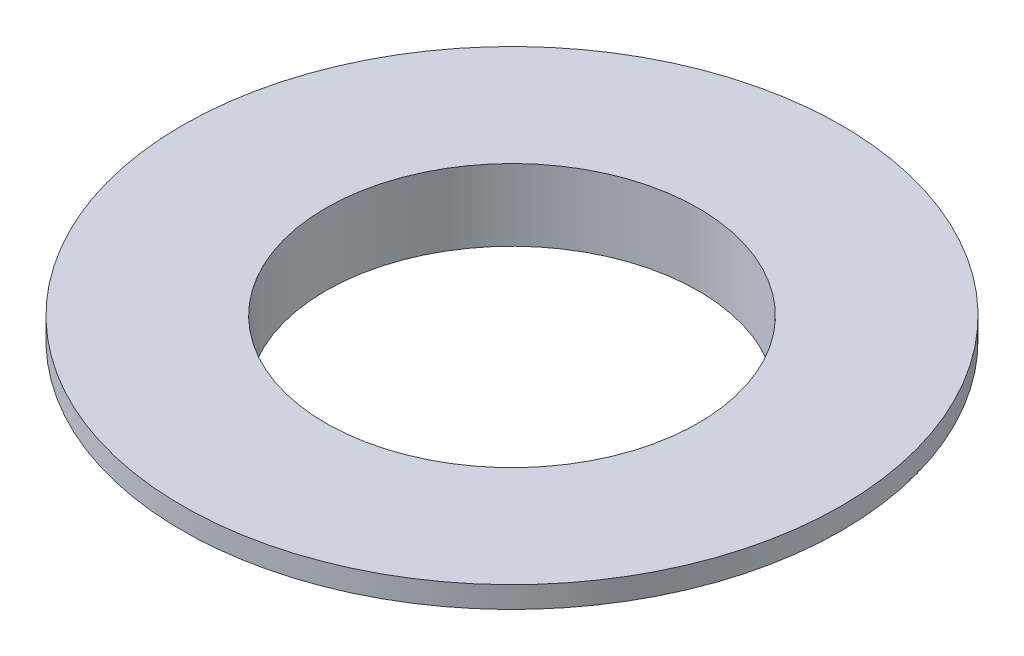
ISO-10303-21;
HEADER;
FILE_DESCRIPTION(('STEP AP214'),'2;1');
FILE_NAME('part.step','',(''),(''),'','','');
FILE_SCHEMA(('AUTOMOTIVE_DESIGN { 1 0 10303 214 1 1 1 1 }'));
ENDSEC;
DATA;
#1=APPLICATION_CONTEXT('core data for automotive mechanical design processes');
#2=APPLICATION_PROTOCOL_DEFINITION('international standard','automotive_design',2000,#1);
#3=PRODUCT_CONTEXT('',#1,'mechanical');
#4=PRODUCT('Part','Part','',(#3));
#5=PRODUCT_RELATED_PRODUCT_CATEGORY('part','',(#4));
#6=PRODUCT_DEFINITION_FORMATION('','',#4);
#7=PRODUCT_DEFINITION_CONTEXT('part definition',#1,'design');
#8=PRODUCT_DEFINITION('design','',#6,#7);
#9=PRODUCT_DEFINITION_SHAPE('','',#8);
#10=(LENGTH_UNIT() NAMED_UNIT(*) SI_UNIT(.MILLI.,.METRE.));
#11=(NAMED_UNIT(*) PLANE_ANGLE_UNIT() SI_UNIT($,.RADIAN.));
#12=(NAMED_UNIT(*) SI_UNIT($,.STERADIAN.) SOLID_ANGLE_UNIT());
#13=UNCERTAINTY_MEASURE_WITH_UNIT(LENGTH_MEASURE(1.E-05),#10,'distance_accuracy_value','');
#14=(GEOMETRIC_REPRESENTATION_CONTEXT(3) GLOBAL_UNCERTAINTY_ASSIGNED_CONTEXT((#13)) GLOBAL_UNIT_ASSIGNED_CONTEXT((#10,
#11,#12)) REPRESENTATION_CONTEXT('',''));
#15=CARTESIAN_POINT('',(0.,0.,0.));
#16=DIRECTION('',(0.,0.,1.));
#17=DIRECTION('',(1.,0.,0.));
#18=AXIS2_PLACEMENT_3D('',#15,#16,#17);
#19=CARTESIAN_POINT('',(4.,0.,0.));
#20=DIRECTION('',(0.,1.,0.));
#21=DIRECTION('',(-1.,0.,0.));
#22=AXIS2_PLACEMENT_3D('',#19,#20,#21);
#23=PLANE('',#22);
#24=CARTESIAN_POINT('',(-26.,0.,0.));
#25=DIRECTION('',(0.,1.,0.));
#26=DIRECTION('',(-1.,0.,0.));
#27=AXIS2_PLACEMENT_3D('',#24,#25,#26);
#28=CIRCLE('',#27,30.);
#29=CARTESIAN_POINT('',(-56.,0.,0.));
#30=VERTEX_POINT('',#29);
#31=EDGE_CURVE('E56',#30,#30,#28,.T.);
#32=ORIENTED_EDGE('',*,*,#31,.F.);
#33=EDGE_LOOP('',(#32));
#34=FACE_BOUND('',#33,.T.);
#35=CARTESIAN_POINT('',(-26.,0.,0.));
#36=DIRECTION('',(0.,1.,0.));
#37=DIRECTION('',(-1.,0.,0.));
#38=AXIS2_PLACEMENT_3D('',#35,#36,#37);
#39=CIRCLE('',#38,26.);
#40=CARTESIAN_POINT('',(-52.,0.,0.));
#41=VERTEX_POINT('',#40);
#42=EDGE_CURVE('E10',#41,#41,#39,.T.);
#43=ORIENTED_EDGE('',*,*,#42,.T.);
#44=EDGE_LOOP('',(#43));
#45=FACE_BOUND('',#44,.T.);
#46=ADVANCED_FACE('F34',(#34,#45),#23,.F.);
#47=CARTESIAN_POINT('',(-26.,37.8689790579778,0.));
#48=DIRECTION('',(0.,1.,0.));
#49=DIRECTION('',(-1.,0.,0.));
#50=AXIS2_PLACEMENT_3D('',#47,#48,#49);
#51=CYLINDRICAL_SURFACE('',#50,26.);
#52=ORIENTED_EDGE('',*,*,#42,.F.);
#53=EDGE_LOOP('',(#52));
#54=FACE_BOUND('',#53,.T.);
#55=CARTESIAN_POINT('',(-26.,10.,0.));
#56=DIRECTION('',(0.,1.,0.));
#57=DIRECTION('',(-1.,0.,0.));
#58=AXIS2_PLACEMENT_3D('',#55,#56,#57);
#59=CIRCLE('',#58,26.);
#60=CARTESIAN_POINT('',(-52.,9.99999999999999,0.));
#61=VERTEX_POINT('',#60);
#62=EDGE_CURVE('E40',#61,#61,#59,.T.);
#63=ORIENTED_EDGE('',*,*,#62,.T.);
#64=EDGE_LOOP('',(#63));
#65=FACE_BOUND('',#64,.T.);
#66=ADVANCED_FACE('F63',(#54,#65),#51,.F.);
#67=CARTESIAN_POINT('',(0.,10.,0.));
#68=DIRECTION('',(0.,-1.,0.));
#69=DIRECTION('',(1.,0.,0.));
#70=AXIS2_PLACEMENT_3D('',#67,#68,#69);
#71=PLANE('',#70);
#72=ORIENTED_EDGE('',*,*,#62,.F.);
#73=EDGE_LOOP('',(#72));
#74=FACE_BOUND('',#73,.T.);
#75=CARTESIAN_POINT('',(-26.,9.99999999999999,0.));
#76=DIRECTION('',(0.,1.,0.));
#77=DIRECTION('',(-1.,0.,0.));
#78=AXIS2_PLACEMENT_3D('',#75,#76,#77);
#79=CIRCLE('',#78,46.);
#80=CARTESIAN_POINT('',(-72.,9.99999999999999,0.));
#81=VERTEX_POINT('',#80);
#82=EDGE_CURVE('E44',#81,#81,#79,.T.);
#83=ORIENTED_EDGE('',*,*,#82,.T.);
#84=EDGE_LOOP('',(#83));
#85=FACE_BOUND('',#84,.T.);
#86=ADVANCED_FACE('F67',(#74,#85),#71,.F.);
#87=CARTESIAN_POINT('',(-26.,37.8689790579778,0.));
#88=DIRECTION('',(0.,1.,0.));
#89=DIRECTION('',(-1.,0.,0.));
#90=AXIS2_PLACEMENT_3D('',#87,#88,#89);
#91=CYLINDRICAL_SURFACE('',#90,46.);
#92=ORIENTED_EDGE('',*,*,#82,.F.);
#93=EDGE_LOOP('',(#92));
#94=FACE_BOUND('',#93,.T.);
#95=CARTESIAN_POINT('',(-26.,7.,0.));
#96=DIRECTION('',(0.,1.,0.));
#97=DIRECTION('',(-1.,0.,0.));
#98=AXIS2_PLACEMENT_3D('',#95,#96,#97);
#99=CIRCLE('',#98,46.);
#100=CARTESIAN_POINT('',(-72.,6.99999999999999,0.));
#101=VERTEX_POINT('',#100);
#102=EDGE_CURVE('E48',#101,#101,#99,.T.);
#103=ORIENTED_EDGE('',*,*,#102,.T.);
#104=EDGE_LOOP('',(#103));
#105=FACE_BOUND('',#104,.T.);
#106=ADVANCED_FACE('F72',(#94,#105),#91,.T.);
#107=CARTESIAN_POINT('',(20.,7.,0.));
#108=DIRECTION('',(0.,1.,0.));
#109=DIRECTION('',(-1.,0.,0.));
#110=AXIS2_PLACEMENT_3D('',#107,#108,#109);
#111=PLANE('',#110);
#112=ORIENTED_EDGE('',*,*,#102,.F.);
#113=EDGE_LOOP('',(#112));
#114=FACE_BOUND('',#113,.T.);
#115=CARTESIAN_POINT('',(-26.,7.,0.));
#116=DIRECTION('',(0.,1.,0.));
#117=DIRECTION('',(-1.,0.,0.));
#118=AXIS2_PLACEMENT_3D('',#115,#116,#117);
#119=CIRCLE('',#118,30.);
#120=CARTESIAN_POINT('',(-56.,6.99999999999999,0.));
#121=VERTEX_POINT('',#120);
#122=EDGE_CURVE('E53',#121,#121,#119,.T.);
#123=ORIENTED_EDGE('',*,*,#122,.T.);
#124=EDGE_LOOP('',(#123));
#125=FACE_BOUND('',#124,.T.);
#126=ADVANCED_FACE('F78',(#114,#125),#111,.F.);
#127=CARTESIAN_POINT('',(-26.,37.8689790579778,0.));
#128=DIRECTION('',(0.,1.,0.));
#129=DIRECTION('',(-1.,0.,0.));
#130=AXIS2_PLACEMENT_3D('',#127,#128,#129);
#131=CYLINDRICAL_SURFACE('',#130,30.);
#132=ORIENTED_EDGE('',*,*,#122,.F.);
#133=EDGE_LOOP('',(#132));
#134=FACE_BOUND('',#133,.T.);
#135=ORIENTED_EDGE('',*,*,#31,.T.);
#136=EDGE_LOOP('',(#135));
#137=FACE_BOUND('',#136,.T.);
#138=ADVANCED_FACE('F60',(#134,#137),#131,.T.);
#139=CLOSED_SHELL('',(#46,#66,#86,#106,#126,#138));
#140=MANIFOLD_SOLID_BREP('B2',#139);
#141=ADVANCED_BREP_SHAPE_REPRESENTATION('',(#18,#140),#14);
#142=SHAPE_DEFINITION_REPRESENTATION(#9,#141);
ENDSEC;
END-ISO-10303-21;
